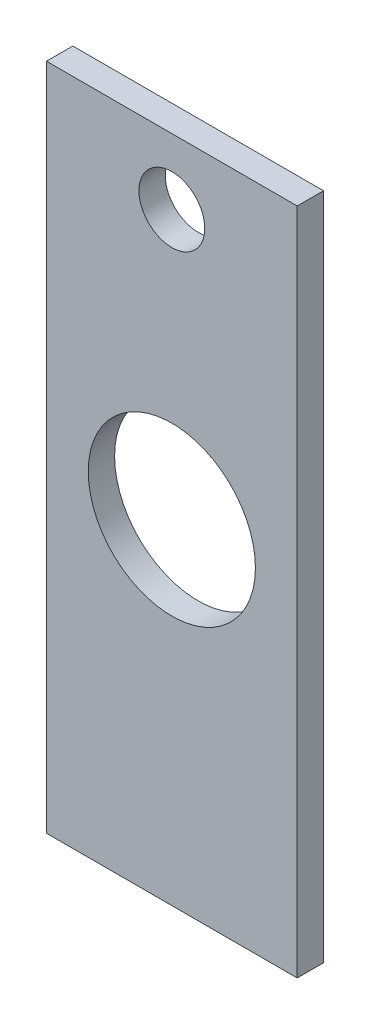
ISO-10303-21;
HEADER;
FILE_DESCRIPTION(('STEP AP214'),'2;1');
FILE_NAME('part.step','',(''),(''),'','','');
FILE_SCHEMA(('AUTOMOTIVE_DESIGN { 1 0 10303 214 1 1 1 1 }'));
ENDSEC;
DATA;
#1=APPLICATION_CONTEXT('core data for automotive mechanical design processes');
#2=APPLICATION_PROTOCOL_DEFINITION('international standard','automotive_design',2000,#1);
#3=PRODUCT_CONTEXT('',#1,'mechanical');
#4=PRODUCT('Part','Part','',(#3));
#5=PRODUCT_RELATED_PRODUCT_CATEGORY('part','',(#4));
#6=PRODUCT_DEFINITION_FORMATION('','',#4);
#7=PRODUCT_DEFINITION_CONTEXT('part definition',#1,'design');
#8=PRODUCT_DEFINITION('design','',#6,#7);
#9=PRODUCT_DEFINITION_SHAPE('','',#8);
#10=(LENGTH_UNIT() NAMED_UNIT(*) SI_UNIT(.MILLI.,.METRE.));
#11=(NAMED_UNIT(*) PLANE_ANGLE_UNIT() SI_UNIT($,.RADIAN.));
#12=(NAMED_UNIT(*) SI_UNIT($,.STERADIAN.) SOLID_ANGLE_UNIT());
#13=UNCERTAINTY_MEASURE_WITH_UNIT(LENGTH_MEASURE(1.E-05),#10,'distance_accuracy_value','');
#14=(GEOMETRIC_REPRESENTATION_CONTEXT(3) GLOBAL_UNCERTAINTY_ASSIGNED_CONTEXT((#13)) GLOBAL_UNIT_ASSIGNED_CONTEXT((#10,
#11,#12)) REPRESENTATION_CONTEXT('',''));
#15=CARTESIAN_POINT('',(0.,0.,0.));
#16=DIRECTION('',(0.,0.,1.));
#17=DIRECTION('',(1.,0.,0.));
#18=AXIS2_PLACEMENT_3D('',#15,#16,#17);
#19=CARTESIAN_POINT('',(0.,0.,2.));
#20=DIRECTION('',(0.,0.,1.));
#21=DIRECTION('',(1.,0.,0.));
#22=AXIS2_PLACEMENT_3D('',#19,#20,#21);
#23=PLANE('',#22);
#24=CARTESIAN_POINT('',(0.,20.4,2.));
#25=DIRECTION('',(0.,0.,1.));
#26=DIRECTION('',(1.,0.,0.));
#27=AXIS2_PLACEMENT_3D('',#24,#25,#26);
#28=CIRCLE('',#27,2.5);
#29=CARTESIAN_POINT('',(2.49999999999999,20.4,2.));
#30=VERTEX_POINT('',#29);
#31=EDGE_CURVE('E133',#30,#30,#28,.T.);
#32=ORIENTED_EDGE('',*,*,#31,.F.);
#33=EDGE_LOOP('',(#32));
#34=FACE_BOUND('',#33,.T.);
#35=DIRECTION('',(0.,-1.,0.));
#36=VECTOR('',#35,1.);
#37=CARTESIAN_POINT('',(-9.52500000000001,25.4,2.));
#38=LINE('',#37,#36);
#39=CARTESIAN_POINT('',(-9.52500000000001,25.4,2.));
#40=VERTEX_POINT('',#39);
#41=CARTESIAN_POINT('',(-9.52500000000001,-25.4,2.));
#42=VERTEX_POINT('',#41);
#43=EDGE_CURVE('E89',#40,#42,#38,.T.);
#44=ORIENTED_EDGE('',*,*,#43,.T.);
#45=DIRECTION('',(1.,0.,0.));
#46=VECTOR('',#45,1.);
#47=CARTESIAN_POINT('',(-9.52500000000001,-25.4,2.));
#48=LINE('',#47,#46);
#49=CARTESIAN_POINT('',(9.525,-25.4,2.));
#50=VERTEX_POINT('',#49);
#51=EDGE_CURVE('E84',#42,#50,#48,.T.);
#52=ORIENTED_EDGE('',*,*,#51,.T.);
#53=DIRECTION('',(0.,1.,0.));
#54=VECTOR('',#53,1.);
#55=CARTESIAN_POINT('',(9.525,25.4,2.));
#56=LINE('',#55,#54);
#57=CARTESIAN_POINT('',(9.525,25.4,2.));
#58=VERTEX_POINT('',#57);
#59=EDGE_CURVE('E87',#50,#58,#56,.T.);
#60=ORIENTED_EDGE('',*,*,#59,.T.);
#61=DIRECTION('',(-1.,0.,0.));
#62=VECTOR('',#61,1.);
#63=CARTESIAN_POINT('',(-9.52500000000001,25.4,2.));
#64=LINE('',#63,#62);
#65=EDGE_CURVE('E54',#58,#40,#64,.T.);
#66=ORIENTED_EDGE('',*,*,#65,.T.);
#67=EDGE_LOOP('',(#44,#52,#60,#66));
#68=FACE_BOUND('',#67,.T.);
#69=CARTESIAN_POINT('',(0.,0.,2.));
#70=DIRECTION('',(0.,0.,1.));
#71=DIRECTION('',(1.,0.,0.));
#72=AXIS2_PLACEMENT_3D('',#69,#70,#71);
#73=CIRCLE('',#72,6.35);
#74=CARTESIAN_POINT('',(6.35,0.,2.));
#75=VERTEX_POINT('',#74);
#76=EDGE_CURVE('E109',#75,#75,#73,.T.);
#77=ORIENTED_EDGE('',*,*,#76,.F.);
#78=EDGE_LOOP('',(#77));
#79=FACE_BOUND('',#78,.T.);
#80=ADVANCED_FACE('F36',(#34,#68,#79),#23,.T.);
#81=CARTESIAN_POINT('',(0.,0.,0.));
#82=DIRECTION('',(0.,0.,1.));
#83=DIRECTION('',(1.,0.,0.));
#84=AXIS2_PLACEMENT_3D('',#81,#82,#83);
#85=PLANE('',#84);
#86=CARTESIAN_POINT('',(0.,20.4,0.));
#87=DIRECTION('',(0.,0.,-1.));
#88=DIRECTION('',(-1.,0.,0.));
#89=AXIS2_PLACEMENT_3D('',#86,#87,#88);
#90=CIRCLE('',#89,2.5);
#91=CARTESIAN_POINT('',(-2.5,20.4,0.));
#92=VERTEX_POINT('',#91);
#93=EDGE_CURVE('E139',#92,#92,#90,.T.);
#94=ORIENTED_EDGE('',*,*,#93,.F.);
#95=EDGE_LOOP('',(#94));
#96=FACE_BOUND('',#95,.T.);
#97=DIRECTION('',(0.,-1.,0.));
#98=VECTOR('',#97,1.);
#99=CARTESIAN_POINT('',(-9.52500000000001,25.4,0.));
#100=LINE('',#99,#98);
#101=CARTESIAN_POINT('',(-9.52500000000001,25.4,0.));
#102=VERTEX_POINT('',#101);
#103=CARTESIAN_POINT('',(-9.52500000000001,-25.4,0.));
#104=VERTEX_POINT('',#103);
#105=EDGE_CURVE('E105',#102,#104,#100,.T.);
#106=ORIENTED_EDGE('',*,*,#105,.F.);
#107=DIRECTION('',(-1.,0.,0.));
#108=VECTOR('',#107,1.);
#109=CARTESIAN_POINT('',(-9.52500000000001,25.4,0.));
#110=LINE('',#109,#108);
#111=CARTESIAN_POINT('',(9.525,25.4,0.));
#112=VERTEX_POINT('',#111);
#113=EDGE_CURVE('E77',#112,#102,#110,.T.);
#114=ORIENTED_EDGE('',*,*,#113,.F.);
#115=DIRECTION('',(0.,1.,0.));
#116=VECTOR('',#115,1.);
#117=CARTESIAN_POINT('',(9.525,25.4,0.));
#118=LINE('',#117,#116);
#119=CARTESIAN_POINT('',(9.525,-25.4,0.));
#120=VERTEX_POINT('',#119);
#121=EDGE_CURVE('E71',#120,#112,#118,.T.);
#122=ORIENTED_EDGE('',*,*,#121,.F.);
#123=DIRECTION('',(1.,0.,0.));
#124=VECTOR('',#123,1.);
#125=CARTESIAN_POINT('',(-9.52500000000001,-25.4,0.));
#126=LINE('',#125,#124);
#127=EDGE_CURVE('E94',#104,#120,#126,.T.);
#128=ORIENTED_EDGE('',*,*,#127,.F.);
#129=EDGE_LOOP('',(#106,#114,#122,#128));
#130=FACE_BOUND('',#129,.T.);
#131=CARTESIAN_POINT('',(0.,0.,0.));
#132=DIRECTION('',(0.,0.,1.));
#133=DIRECTION('',(1.,0.,0.));
#134=AXIS2_PLACEMENT_3D('',#131,#132,#133);
#135=CIRCLE('',#134,6.35);
#136=CARTESIAN_POINT('',(6.35,0.,0.));
#137=VERTEX_POINT('',#136);
#138=EDGE_CURVE('E129',#137,#137,#135,.T.);
#139=ORIENTED_EDGE('',*,*,#138,.T.);
#140=EDGE_LOOP('',(#139));
#141=FACE_BOUND('',#140,.T.);
#142=ADVANCED_FACE('F124',(#96,#130,#141),#85,.F.);
#143=CARTESIAN_POINT('',(-9.52500000000001,25.4,2.));
#144=DIRECTION('',(1.,0.,0.));
#145=DIRECTION('',(0.,0.,-1.));
#146=AXIS2_PLACEMENT_3D('',#143,#144,#145);
#147=PLANE('',#146);
#148=ORIENTED_EDGE('',*,*,#105,.T.);
#149=DIRECTION('',(0.,0.,-1.));
#150=VECTOR('',#149,1.);
#151=CARTESIAN_POINT('',(-9.52500000000001,-25.4,2.));
#152=LINE('',#151,#150);
#153=EDGE_CURVE('E11',#42,#104,#152,.T.);
#154=ORIENTED_EDGE('',*,*,#153,.F.);
#155=ORIENTED_EDGE('',*,*,#43,.F.);
#156=DIRECTION('',(0.,0.,-1.));
#157=VECTOR('',#156,1.);
#158=CARTESIAN_POINT('',(-9.52500000000001,25.4,2.));
#159=LINE('',#158,#157);
#160=EDGE_CURVE('E101',#40,#102,#159,.T.);
#161=ORIENTED_EDGE('',*,*,#160,.T.);
#162=EDGE_LOOP('',(#148,#154,#155,#161));
#163=FACE_BOUND('',#162,.T.);
#164=ADVANCED_FACE('F38',(#163),#147,.F.);
#165=CARTESIAN_POINT('',(-9.52500000000001,-25.4,2.));
#166=DIRECTION('',(0.,1.,0.));
#167=DIRECTION('',(0.,0.,1.));
#168=AXIS2_PLACEMENT_3D('',#165,#166,#167);
#169=PLANE('',#168);
#170=ORIENTED_EDGE('',*,*,#127,.T.);
#171=DIRECTION('',(0.,0.,-1.));
#172=VECTOR('',#171,1.);
#173=CARTESIAN_POINT('',(9.525,-25.4,2.));
#174=LINE('',#173,#172);
#175=EDGE_CURVE('E46',#50,#120,#174,.T.);
#176=ORIENTED_EDGE('',*,*,#175,.F.);
#177=ORIENTED_EDGE('',*,*,#51,.F.);
#178=ORIENTED_EDGE('',*,*,#153,.T.);
#179=EDGE_LOOP('',(#170,#176,#177,#178));
#180=FACE_BOUND('',#179,.T.);
#181=ADVANCED_FACE('F93',(#180),#169,.F.);
#182=CARTESIAN_POINT('',(9.525,25.4,2.));
#183=DIRECTION('',(-1.,0.,0.));
#184=DIRECTION('',(0.,0.,1.));
#185=AXIS2_PLACEMENT_3D('',#182,#183,#184);
#186=PLANE('',#185);
#187=ORIENTED_EDGE('',*,*,#121,.T.);
#188=DIRECTION('',(0.,0.,-1.));
#189=VECTOR('',#188,1.);
#190=CARTESIAN_POINT('',(9.525,25.4,2.));
#191=LINE('',#190,#189);
#192=EDGE_CURVE('E96',#58,#112,#191,.T.);
#193=ORIENTED_EDGE('',*,*,#192,.F.);
#194=ORIENTED_EDGE('',*,*,#59,.F.);
#195=ORIENTED_EDGE('',*,*,#175,.T.);
#196=EDGE_LOOP('',(#187,#193,#194,#195));
#197=FACE_BOUND('',#196,.T.);
#198=ADVANCED_FACE('F97',(#197),#186,.F.);
#199=CARTESIAN_POINT('',(-9.52500000000001,25.4,2.));
#200=DIRECTION('',(0.,-1.,0.));
#201=DIRECTION('',(0.,0.,-1.));
#202=AXIS2_PLACEMENT_3D('',#199,#200,#201);
#203=PLANE('',#202);
#204=ORIENTED_EDGE('',*,*,#113,.T.);
#205=ORIENTED_EDGE('',*,*,#160,.F.);
#206=ORIENTED_EDGE('',*,*,#65,.F.);
#207=ORIENTED_EDGE('',*,*,#192,.T.);
#208=EDGE_LOOP('',(#204,#205,#206,#207));
#209=FACE_BOUND('',#208,.T.);
#210=ADVANCED_FACE('F121',(#209),#203,.F.);
#211=CARTESIAN_POINT('',(0.,0.,2.));
#212=DIRECTION('',(0.,0.,-1.));
#213=DIRECTION('',(-1.,0.,0.));
#214=AXIS2_PLACEMENT_3D('',#211,#212,#213);
#215=CYLINDRICAL_SURFACE('',#214,6.35);
#216=ORIENTED_EDGE('',*,*,#76,.T.);
#217=EDGE_LOOP('',(#216));
#218=FACE_BOUND('',#217,.T.);
#219=ORIENTED_EDGE('',*,*,#138,.F.);
#220=EDGE_LOOP('',(#219));
#221=FACE_BOUND('',#220,.T.);
#222=ADVANCED_FACE('F157',(#218,#221),#215,.F.);
#223=CARTESIAN_POINT('',(0.,20.4,0.));
#224=DIRECTION('',(0.,0.,-1.));
#225=DIRECTION('',(-1.,0.,0.));
#226=AXIS2_PLACEMENT_3D('',#223,#224,#225);
#227=CYLINDRICAL_SURFACE('',#226,2.5);
#228=ORIENTED_EDGE('',*,*,#31,.T.);
#229=EDGE_LOOP('',(#228));
#230=FACE_BOUND('',#229,.T.);
#231=ORIENTED_EDGE('',*,*,#93,.T.);
#232=EDGE_LOOP('',(#231));
#233=FACE_BOUND('',#232,.T.);
#234=ADVANCED_FACE('F143',(#230,#233),#227,.F.);
#235=CLOSED_SHELL('',(#80,#142,#164,#181,#198,#210,#222,#234));
#236=MANIFOLD_SOLID_BREP('B2',#235);
#237=ADVANCED_BREP_SHAPE_REPRESENTATION('',(#18,#236),#14);
#238=SHAPE_DEFINITION_REPRESENTATION(#9,#237);
ENDSEC;
END-ISO-10303-21;
